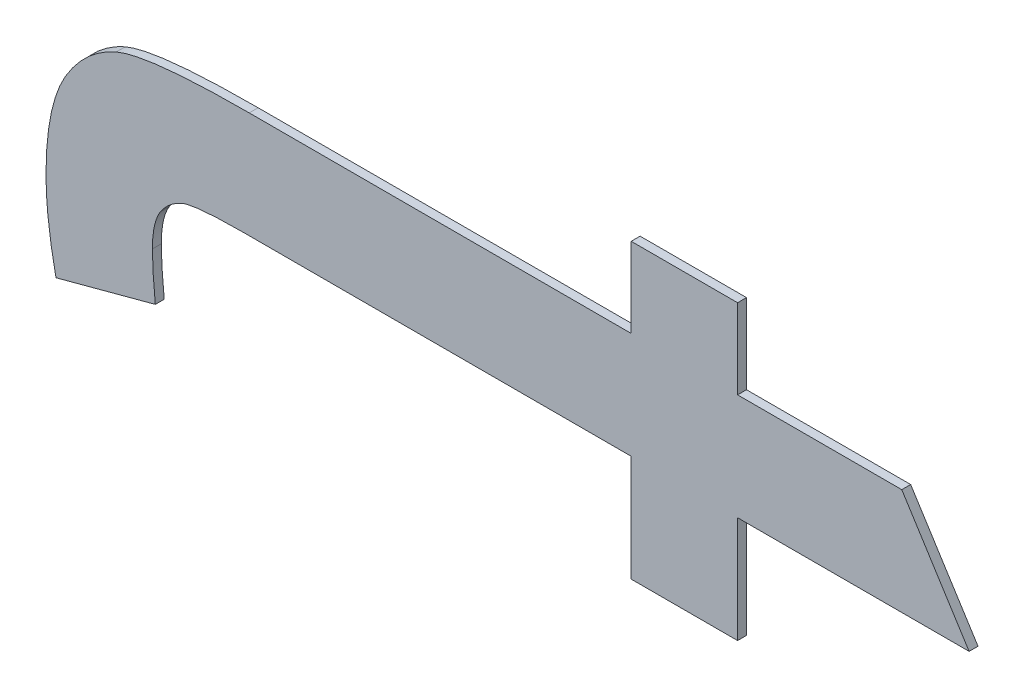
ISO-10303-21;
HEADER;
FILE_DESCRIPTION(('STEP AP214'),'2;1');
FILE_NAME('part.step','',(''),(''),'','','');
FILE_SCHEMA(('AUTOMOTIVE_DESIGN { 1 0 10303 214 1 1 1 1 }'));
ENDSEC;
DATA;
#1=APPLICATION_CONTEXT('core data for automotive mechanical design processes');
#2=APPLICATION_PROTOCOL_DEFINITION('international standard','automotive_design',2000,#1);
#3=PRODUCT_CONTEXT('',#1,'mechanical');
#4=PRODUCT('Part','Part','',(#3));
#5=PRODUCT_RELATED_PRODUCT_CATEGORY('part','',(#4));
#6=PRODUCT_DEFINITION_FORMATION('','',#4);
#7=PRODUCT_DEFINITION_CONTEXT('part definition',#1,'design');
#8=PRODUCT_DEFINITION('design','',#6,#7);
#9=PRODUCT_DEFINITION_SHAPE('','',#8);
#10=(LENGTH_UNIT() NAMED_UNIT(*) SI_UNIT(.MILLI.,.METRE.));
#11=(NAMED_UNIT(*) PLANE_ANGLE_UNIT() SI_UNIT($,.RADIAN.));
#12=(NAMED_UNIT(*) SI_UNIT($,.STERADIAN.) SOLID_ANGLE_UNIT());
#13=UNCERTAINTY_MEASURE_WITH_UNIT(LENGTH_MEASURE(1.E-05),#10,'distance_accuracy_value','');
#14=(GEOMETRIC_REPRESENTATION_CONTEXT(3) GLOBAL_UNCERTAINTY_ASSIGNED_CONTEXT((#13)) GLOBAL_UNIT_ASSIGNED_CONTEXT((#10,
#11,#12)) REPRESENTATION_CONTEXT('',''));
#15=CARTESIAN_POINT('',(0.,0.,0.));
#16=DIRECTION('',(0.,0.,1.));
#17=DIRECTION('',(1.,0.,0.));
#18=AXIS2_PLACEMENT_3D('',#15,#16,#17);
#19=CARTESIAN_POINT('',(1.0877452835503,1.4763023259655,1.7496000059366));
#20=DIRECTION('',(0.258668743012333,-0.965966087079883,0.));
#21=DIRECTION('',(0.,0.,-1.));
#22=AXIS2_PLACEMENT_3D('',#19,#20,#21);
#23=PLANE('',#22);
#24=DIRECTION('',(0.,0.,1.));
#25=VECTOR('',#24,1.);
#26=CARTESIAN_POINT('',(1.0899779799409,1.4769002028233,1.7492000059366));
#27=LINE('',#26,#25);
#28=CARTESIAN_POINT('',(1.0899779799409,1.4769002028233,1.7492000059366));
#29=VERTEX_POINT('',#28);
#30=CARTESIAN_POINT('',(1.0899779799409,1.4769002028233,1.7496000059366));
#31=VERTEX_POINT('',#30);
#32=EDGE_CURVE('E11',#29,#31,#27,.T.);
#33=ORIENTED_EDGE('',*,*,#32,.T.);
#34=DIRECTION('',(-0.965966087079883,-0.258668743012333,0.));
#35=VECTOR('',#34,1.);
#36=CARTESIAN_POINT('',(1.0899779799409,1.4769002028233,1.7496000059366));
#37=LINE('',#36,#35);
#38=CARTESIAN_POINT('',(1.0855125871597,1.4757044491077,1.7496000059366));
#39=VERTEX_POINT('',#38);
#40=EDGE_CURVE('E24',#31,#39,#37,.T.);
#41=ORIENTED_EDGE('',*,*,#40,.T.);
#42=DIRECTION('',(0.,0.,1.));
#43=VECTOR('',#42,1.);
#44=CARTESIAN_POINT('',(1.0855125871597,1.4757044491077,1.7492000059366));
#45=LINE('',#44,#43);
#46=CARTESIAN_POINT('',(1.0855125871597,1.4757044491077,1.7492000059366));
#47=VERTEX_POINT('',#46);
#48=EDGE_CURVE('E389',#47,#39,#45,.T.);
#49=ORIENTED_EDGE('',*,*,#48,.F.);
#50=DIRECTION('',(-0.965966087079883,-0.258668743012333,0.));
#51=VECTOR('',#50,1.);
#52=CARTESIAN_POINT('',(1.0899779799409,1.4769002028233,1.7492000059366));
#53=LINE('',#52,#51);
#54=EDGE_CURVE('E384',#29,#47,#53,.T.);
#55=ORIENTED_EDGE('',*,*,#54,.F.);
#56=EDGE_LOOP('',(#33,#41,#49,#55));
#57=FACE_BOUND('',#56,.T.);
#58=ADVANCED_FACE('F17',(#57),#23,.T.);
#59=CARTESIAN_POINT('',(1.0855125871597,1.4757044491077,1.7496000059366));
#60=CARTESIAN_POINT('',(1.0855125871597,1.4757044491077,1.7491200059366));
#61=CARTESIAN_POINT('',(1.0850641795163,1.4778157017617,1.7496000059366));
#62=CARTESIAN_POINT('',(1.0850641795163,1.4778157017617,1.7491200059366));
#63=CARTESIAN_POINT('',(1.0850641795163,1.4794972304241,1.7496000059366));
#64=CARTESIAN_POINT('',(1.0850641795163,1.4794972304241,1.7491200059366));
#65=B_SPLINE_SURFACE_WITH_KNOTS('',2,1,((#59,#60),(#61,#62),(#63,#64)),.UNSPECIFIED.,.F.,.F.,
.F.,(3,3),(2,2),(0.,1.),(0.,0.000239999999999974),.UNSPECIFIED.);
#66=CARTESIAN_POINT('',(1.0855125871597,1.4757044491077,1.7496000059366));
#67=CARTESIAN_POINT('',(1.0850641795163,1.4778157017617,1.7496000059366));
#68=CARTESIAN_POINT('',(1.0850641795163,1.4794972304241,1.7496000059366));
#69=B_SPLINE_CURVE_WITH_KNOTS('',2,(#66,#67,#68),.UNSPECIFIED.,.F.,.F.,(3,3),(0.,1.),.UNSPECIFIED.);
#70=CARTESIAN_POINT('',(1.0850641795163,1.4794972304241,1.7496000059366));
#71=VERTEX_POINT('',#70);
#72=EDGE_CURVE('E380',#39,#71,#69,.T.);
#73=DIRECTION('',(0.,0.,1.));
#74=VECTOR('',#73,1.);
#75=CARTESIAN_POINT('',(1.0850641795163,1.4794972304241,1.7492000059366));
#76=LINE('',#75,#74);
#77=CARTESIAN_POINT('',(1.0850641795163,1.4794972304241,1.7492000059366));
#78=VERTEX_POINT('',#77);
#79=EDGE_CURVE('E374',#78,#71,#76,.T.);
#80=CARTESIAN_POINT('',(1.0855125871597,1.4757044491077,1.7492000059366));
#81=CARTESIAN_POINT('',(1.0850641795163,1.4778157017617,1.7492000059366));
#82=CARTESIAN_POINT('',(1.0850641795163,1.4794972304241,1.7492000059366));
#83=B_SPLINE_CURVE_WITH_KNOTS('',2,(#80,#81,#82),.UNSPECIFIED.,.F.,.F.,(3,3),(0.,1.),.UNSPECIFIED.);
#84=EDGE_CURVE('E366',#47,#78,#83,.T.);
#85=ORIENTED_EDGE('',*,*,#48,.T.);
#86=ORIENTED_EDGE('',*,*,#72,.T.);
#87=ORIENTED_EDGE('',*,*,#79,.F.);
#88=ORIENTED_EDGE('',*,*,#84,.F.);
#89=EDGE_LOOP('',(#85,#86,#87,#88));
#90=FACE_BOUND('',#89,.T.);
#91=ADVANCED_FACE('F395',(#90),#65,.T.);
#92=CARTESIAN_POINT('',(1.0850641795163,1.4794972304241,1.7496000059366));
#93=CARTESIAN_POINT('',(1.0850641795163,1.4794972304241,1.7491200059366));
#94=CARTESIAN_POINT('',(1.0850641795163,1.4822250435875,1.7496000059366));
#95=CARTESIAN_POINT('',(1.0850641795163,1.4822250435875,1.7491200059366));
#96=CARTESIAN_POINT('',(1.0859236274993,1.4837384193837,1.7496000059366));
#97=CARTESIAN_POINT('',(1.0859236274993,1.4837384193837,1.7491200059366));
#98=B_SPLINE_SURFACE_WITH_KNOTS('',2,1,((#92,#93),(#94,#95),(#96,#97)),.UNSPECIFIED.,.F.,.F.,
.F.,(3,3),(2,2),(0.,1.),(0.,0.000239999999999974),.UNSPECIFIED.);
#99=CARTESIAN_POINT('',(1.0850641795163,1.4794972304241,1.7496000059366));
#100=CARTESIAN_POINT('',(1.0850641795163,1.4822250435875,1.7496000059366));
#101=CARTESIAN_POINT('',(1.0859236274993,1.4837384193837,1.7496000059366));
#102=B_SPLINE_CURVE_WITH_KNOTS('',2,(#99,#100,#101),.UNSPECIFIED.,.F.,.F.,(3,3),(0.,1.),.UNSPECIFIED.);
#103=CARTESIAN_POINT('',(1.0859236274993,1.4837384193837,1.7496000059366));
#104=VERTEX_POINT('',#103);
#105=EDGE_CURVE('E362',#71,#104,#102,.T.);
#106=DIRECTION('',(0.,0.,1.));
#107=VECTOR('',#106,1.);
#108=CARTESIAN_POINT('',(1.0859236274993,1.4837384193837,1.7492000059366));
#109=LINE('',#108,#107);
#110=CARTESIAN_POINT('',(1.0859236274993,1.4837384193837,1.7492000059366));
#111=VERTEX_POINT('',#110);
#112=EDGE_CURVE('E356',#111,#104,#109,.T.);
#113=CARTESIAN_POINT('',(1.0850641795163,1.4794972304241,1.7492000059366));
#114=CARTESIAN_POINT('',(1.0850641795163,1.4822250435875,1.7492000059366));
#115=CARTESIAN_POINT('',(1.0859236274993,1.4837384193837,1.7492000059366));
#116=B_SPLINE_CURVE_WITH_KNOTS('',2,(#113,#114,#115),.UNSPECIFIED.,.F.,.F.,(3,3),(0.,1.),.UNSPECIFIED.);
#117=EDGE_CURVE('E348',#78,#111,#116,.T.);
#118=ORIENTED_EDGE('',*,*,#79,.T.);
#119=ORIENTED_EDGE('',*,*,#105,.T.);
#120=ORIENTED_EDGE('',*,*,#112,.F.);
#121=ORIENTED_EDGE('',*,*,#117,.F.);
#122=EDGE_LOOP('',(#118,#119,#120,#121));
#123=FACE_BOUND('',#122,.T.);
#124=ADVANCED_FACE('F401',(#123),#98,.T.);
#125=CARTESIAN_POINT('',(1.0859236274993,1.4837384193837,1.7496000059366));
#126=CARTESIAN_POINT('',(1.0859236274993,1.4837384193837,1.7491200059366));
#127=CARTESIAN_POINT('',(1.0868017591341,1.4852331115281,1.7496000059366));
#128=CARTESIAN_POINT('',(1.0868017591341,1.4852331115281,1.7491200059366));
#129=CARTESIAN_POINT('',(1.0882217166713,1.4858496720377,1.7496000059366));
#130=CARTESIAN_POINT('',(1.0882217166713,1.4858496720377,1.7491200059366));
#131=B_SPLINE_SURFACE_WITH_KNOTS('',2,1,((#125,#126),(#127,#128),(#129,#130)),.UNSPECIFIED.,.F.,
.F.,.F.,(3,3),(2,2),(0.,1.),(0.,0.000239999999999974),.UNSPECIFIED.);
#132=CARTESIAN_POINT('',(1.0859236274993,1.4837384193837,1.7496000059366));
#133=CARTESIAN_POINT('',(1.0868017591341,1.4852331115281,1.7496000059366));
#134=CARTESIAN_POINT('',(1.0882217166713,1.4858496720377,1.7496000059366));
#135=B_SPLINE_CURVE_WITH_KNOTS('',2,(#132,#133,#134),.UNSPECIFIED.,.F.,.F.,(3,3),(0.,1.),.UNSPECIFIED.);
#136=CARTESIAN_POINT('',(1.0882217166713,1.4858496720377,1.7496000059366));
#137=VERTEX_POINT('',#136);
#138=EDGE_CURVE('E344',#104,#137,#135,.T.);
#139=DIRECTION('',(0.,0.,1.));
#140=VECTOR('',#139,1.);
#141=CARTESIAN_POINT('',(1.0882217166713,1.4858496720377,1.7492000059366));
#142=LINE('',#141,#140);
#143=CARTESIAN_POINT('',(1.0882217166713,1.4858496720377,1.7492000059366));
#144=VERTEX_POINT('',#143);
#145=EDGE_CURVE('E338',#144,#137,#142,.T.);
#146=CARTESIAN_POINT('',(1.0859236274993,1.4837384193837,1.7492000059366));
#147=CARTESIAN_POINT('',(1.0868017591341,1.4852331115281,1.7492000059366));
#148=CARTESIAN_POINT('',(1.0882217166713,1.4858496720377,1.7492000059366));
#149=B_SPLINE_CURVE_WITH_KNOTS('',2,(#146,#147,#148),.UNSPECIFIED.,.F.,.F.,(3,3),(0.,1.),.UNSPECIFIED.);
#150=EDGE_CURVE('E330',#111,#144,#149,.T.);
#151=ORIENTED_EDGE('',*,*,#112,.T.);
#152=ORIENTED_EDGE('',*,*,#138,.T.);
#153=ORIENTED_EDGE('',*,*,#145,.F.);
#154=ORIENTED_EDGE('',*,*,#150,.F.);
#155=EDGE_LOOP('',(#151,#152,#153,#154));
#156=FACE_BOUND('',#155,.T.);
#157=ADVANCED_FACE('F405',(#156),#131,.T.);
#158=CARTESIAN_POINT('',(1.0882217166713,1.4858496720377,1.7496000059366));
#159=CARTESIAN_POINT('',(1.0882217166713,1.4858496720377,1.7491200059366));
#160=CARTESIAN_POINT('',(1.0896416742085,1.4864662325471,1.7496000059366));
#161=CARTESIAN_POINT('',(1.0896416742085,1.4864662325471,1.7491200059366));
#162=CARTESIAN_POINT('',(1.0942004852487,1.4864662325471,1.7496000059366));
#163=CARTESIAN_POINT('',(1.0942004852487,1.4864662325471,1.7491200059366));
#164=B_SPLINE_SURFACE_WITH_KNOTS('',2,1,((#158,#159),(#160,#161),(#162,#163)),.UNSPECIFIED.,.F.,
.F.,.F.,(3,3),(2,2),(0.,1.),(0.,0.000239999999999974),.UNSPECIFIED.);
#165=CARTESIAN_POINT('',(1.0882217166713,1.4858496720377,1.7496000059366));
#166=CARTESIAN_POINT('',(1.0896416742085,1.4864662325471,1.7496000059366));
#167=CARTESIAN_POINT('',(1.0942004852487,1.4864662325471,1.7496000059366));
#168=B_SPLINE_CURVE_WITH_KNOTS('',2,(#165,#166,#167),.UNSPECIFIED.,.F.,.F.,(3,3),(0.,1.),.UNSPECIFIED.);
#169=CARTESIAN_POINT('',(1.0942004852487,1.4864662325471,1.7496000059366));
#170=VERTEX_POINT('',#169);
#171=EDGE_CURVE('E326',#137,#170,#168,.T.);
#172=DIRECTION('',(0.,0.,1.));
#173=VECTOR('',#172,1.);
#174=CARTESIAN_POINT('',(1.0942004852487,1.4864662325471,1.7492000059366));
#175=LINE('',#174,#173);
#176=CARTESIAN_POINT('',(1.0942004852487,1.4864662325471,1.7492000059366));
#177=VERTEX_POINT('',#176);
#178=EDGE_CURVE('E320',#177,#170,#175,.T.);
#179=CARTESIAN_POINT('',(1.0882217166713,1.4858496720377,1.7492000059366));
#180=CARTESIAN_POINT('',(1.0896416742085,1.4864662325471,1.7492000059366));
#181=CARTESIAN_POINT('',(1.0942004852487,1.4864662325471,1.7492000059366));
#182=B_SPLINE_CURVE_WITH_KNOTS('',2,(#179,#180,#181),.UNSPECIFIED.,.F.,.F.,(3,3),(0.,1.),.UNSPECIFIED.);
#183=EDGE_CURVE('E315',#144,#177,#182,.T.);
#184=ORIENTED_EDGE('',*,*,#145,.T.);
#185=ORIENTED_EDGE('',*,*,#171,.T.);
#186=ORIENTED_EDGE('',*,*,#178,.F.);
#187=ORIENTED_EDGE('',*,*,#183,.F.);
#188=EDGE_LOOP('',(#184,#185,#186,#187));
#189=FACE_BOUND('',#188,.T.);
#190=ADVANCED_FACE('F409',(#189),#164,.T.);
#191=CARTESIAN_POINT('',(1.102785623253,1.4864662325471,1.7496000059366));
#192=DIRECTION('',(0.,1.,0.));
#193=DIRECTION('',(0.,0.,1.));
#194=AXIS2_PLACEMENT_3D('',#191,#192,#193);
#195=PLANE('',#194);
#196=ORIENTED_EDGE('',*,*,#178,.T.);
#197=DIRECTION('',(1.,0.,0.));
#198=VECTOR('',#197,1.);
#199=CARTESIAN_POINT('',(1.0942004852487,1.4864662325471,1.7496000059366));
#200=LINE('',#199,#198);
#201=CARTESIAN_POINT('',(1.1113707612573,1.4864662325471,1.7496000059366));
#202=VERTEX_POINT('',#201);
#203=EDGE_CURVE('E313',#170,#202,#200,.T.);
#204=ORIENTED_EDGE('',*,*,#203,.T.);
#205=DIRECTION('',(0.,0.,1.));
#206=VECTOR('',#205,1.);
#207=CARTESIAN_POINT('',(1.1113707612573,1.4864662325471,1.7492000059366));
#208=LINE('',#207,#206);
#209=CARTESIAN_POINT('',(1.1113707612573,1.4864662325471,1.7492000059366));
#210=VERTEX_POINT('',#209);
#211=EDGE_CURVE('E310',#210,#202,#208,.T.);
#212=ORIENTED_EDGE('',*,*,#211,.F.);
#213=DIRECTION('',(1.,0.,0.));
#214=VECTOR('',#213,1.);
#215=CARTESIAN_POINT('',(1.0942004852487,1.4864662325471,1.7492000059366));
#216=LINE('',#215,#214);
#217=EDGE_CURVE('E307',#177,#210,#216,.T.);
#218=ORIENTED_EDGE('',*,*,#217,.F.);
#219=EDGE_LOOP('',(#196,#204,#212,#218));
#220=FACE_BOUND('',#219,.T.);
#221=ADVANCED_FACE('F412',(#220),#195,.T.);
#222=CARTESIAN_POINT('',(1.1113707612573,1.4882598631204,1.7496000059366));
#223=DIRECTION('',(-1.,0.,0.));
#224=DIRECTION('',(0.,0.,1.));
#225=AXIS2_PLACEMENT_3D('',#222,#223,#224);
#226=PLANE('',#225);
#227=ORIENTED_EDGE('',*,*,#211,.T.);
#228=DIRECTION('',(0.,1.,0.));
#229=VECTOR('',#228,1.);
#230=CARTESIAN_POINT('',(1.1113707612573,1.4864662325471,1.7496000059366));
#231=LINE('',#230,#229);
#232=CARTESIAN_POINT('',(1.1113707612573,1.4900534936937,1.7496000059366));
#233=VERTEX_POINT('',#232);
#234=EDGE_CURVE('E305',#202,#233,#231,.T.);
#235=ORIENTED_EDGE('',*,*,#234,.T.);
#236=DIRECTION('',(0.,0.,1.));
#237=VECTOR('',#236,1.);
#238=CARTESIAN_POINT('',(1.1113707612573,1.4900534936937,1.7492000059366));
#239=LINE('',#238,#237);
#240=CARTESIAN_POINT('',(1.1113707612573,1.4900534936937,1.7492000059366));
#241=VERTEX_POINT('',#240);
#242=EDGE_CURVE('E302',#241,#233,#239,.T.);
#243=ORIENTED_EDGE('',*,*,#242,.F.);
#244=DIRECTION('',(0.,1.,0.));
#245=VECTOR('',#244,1.);
#246=CARTESIAN_POINT('',(1.1113707612573,1.4864662325471,1.7492000059366));
#247=LINE('',#246,#245);
#248=EDGE_CURVE('E299',#210,#241,#247,.T.);
#249=ORIENTED_EDGE('',*,*,#248,.F.);
#250=EDGE_LOOP('',(#227,#235,#243,#249));
#251=FACE_BOUND('',#250,.T.);
#252=ADVANCED_FACE('F417',(#251),#226,.T.);
#253=CARTESIAN_POINT('',(1.1137622686883,1.4900534936937,1.7496000059366));
#254=DIRECTION('',(0.,1.,0.));
#255=DIRECTION('',(0.,0.,1.));
#256=AXIS2_PLACEMENT_3D('',#253,#254,#255);
#257=PLANE('',#256);
#258=ORIENTED_EDGE('',*,*,#242,.T.);
#259=DIRECTION('',(1.,0.,0.));
#260=VECTOR('',#259,1.);
#261=CARTESIAN_POINT('',(1.1113707612573,1.4900534936937,1.7496000059366));
#262=LINE('',#261,#260);
#263=CARTESIAN_POINT('',(1.1161537761193,1.4900534936937,1.7496000059366));
#264=VERTEX_POINT('',#263);
#265=EDGE_CURVE('E297',#233,#264,#262,.T.);
#266=ORIENTED_EDGE('',*,*,#265,.T.);
#267=DIRECTION('',(0.,0.,1.));
#268=VECTOR('',#267,1.);
#269=CARTESIAN_POINT('',(1.1161537761193,1.4900534936937,1.7492000059366));
#270=LINE('',#269,#268);
#271=CARTESIAN_POINT('',(1.1161537761193,1.4900534936937,1.7492000059366));
#272=VERTEX_POINT('',#271);
#273=EDGE_CURVE('E294',#272,#264,#270,.T.);
#274=ORIENTED_EDGE('',*,*,#273,.F.);
#275=DIRECTION('',(1.,0.,0.));
#276=VECTOR('',#275,1.);
#277=CARTESIAN_POINT('',(1.1113707612573,1.4900534936937,1.7492000059366));
#278=LINE('',#277,#276);
#279=EDGE_CURVE('E291',#241,#272,#278,.T.);
#280=ORIENTED_EDGE('',*,*,#279,.F.);
#281=EDGE_LOOP('',(#258,#266,#274,#280));
#282=FACE_BOUND('',#281,.T.);
#283=ADVANCED_FACE('F421',(#282),#257,.T.);
#284=CARTESIAN_POINT('',(1.1161537761193,1.4882598631204,1.7496000059366));
#285=DIRECTION('',(1.,0.,0.));
#286=DIRECTION('',(0.,0.,-1.));
#287=AXIS2_PLACEMENT_3D('',#284,#285,#286);
#288=PLANE('',#287);
#289=ORIENTED_EDGE('',*,*,#273,.T.);
#290=DIRECTION('',(0.,-1.,0.));
#291=VECTOR('',#290,1.);
#292=CARTESIAN_POINT('',(1.1161537761193,1.4900534936937,1.7496000059366));
#293=LINE('',#292,#291);
#294=CARTESIAN_POINT('',(1.1161537761193,1.4864662325471,1.7496000059366));
#295=VERTEX_POINT('',#294);
#296=EDGE_CURVE('E289',#264,#295,#293,.T.);
#297=ORIENTED_EDGE('',*,*,#296,.T.);
#298=DIRECTION('',(0.,0.,1.));
#299=VECTOR('',#298,1.);
#300=CARTESIAN_POINT('',(1.1161537761193,1.4864662325471,1.7492000059366));
#301=LINE('',#300,#299);
#302=CARTESIAN_POINT('',(1.1161537761193,1.4864662325471,1.7492000059366));
#303=VERTEX_POINT('',#302);
#304=EDGE_CURVE('E286',#303,#295,#301,.T.);
#305=ORIENTED_EDGE('',*,*,#304,.F.);
#306=DIRECTION('',(0.,-1.,0.));
#307=VECTOR('',#306,1.);
#308=CARTESIAN_POINT('',(1.1161537761193,1.4900534936937,1.7492000059366));
#309=LINE('',#308,#307);
#310=EDGE_CURVE('E283',#272,#303,#309,.T.);
#311=ORIENTED_EDGE('',*,*,#310,.F.);
#312=EDGE_LOOP('',(#289,#297,#305,#311));
#313=FACE_BOUND('',#312,.T.);
#314=ADVANCED_FACE('F425',(#313),#288,.T.);
#315=CARTESIAN_POINT('',(1.1198437973507,1.4864662325471,1.7496000059366));
#316=DIRECTION('',(0.,1.,0.));
#317=DIRECTION('',(0.,0.,1.));
#318=AXIS2_PLACEMENT_3D('',#315,#316,#317);
#319=PLANE('',#318);
#320=ORIENTED_EDGE('',*,*,#304,.T.);
#321=DIRECTION('',(1.,0.,0.));
#322=VECTOR('',#321,1.);
#323=CARTESIAN_POINT('',(1.1161537761193,1.4864662325471,1.7496000059366));
#324=LINE('',#323,#322);
#325=CARTESIAN_POINT('',(1.1235338185821,1.4864662325471,1.7496000059366));
#326=VERTEX_POINT('',#325);
#327=EDGE_CURVE('E281',#295,#326,#324,.T.);
#328=ORIENTED_EDGE('',*,*,#327,.T.);
#329=DIRECTION('',(0.,0.,1.));
#330=VECTOR('',#329,1.);
#331=CARTESIAN_POINT('',(1.1235338185821,1.4864662325471,1.7492000059366));
#332=LINE('',#331,#330);
#333=CARTESIAN_POINT('',(1.1235338185821,1.4864662325471,1.7492000059366));
#334=VERTEX_POINT('',#333);
#335=EDGE_CURVE('E278',#334,#326,#332,.T.);
#336=ORIENTED_EDGE('',*,*,#335,.F.);
#337=DIRECTION('',(1.,0.,0.));
#338=VECTOR('',#337,1.);
#339=CARTESIAN_POINT('',(1.1161537761193,1.4864662325471,1.7492000059366));
#340=LINE('',#339,#338);
#341=EDGE_CURVE('E275',#303,#334,#340,.T.);
#342=ORIENTED_EDGE('',*,*,#341,.F.);
#343=EDGE_LOOP('',(#320,#328,#336,#342));
#344=FACE_BOUND('',#343,.T.);
#345=ADVANCED_FACE('F428',(#344),#319,.T.);
#346=CARTESIAN_POINT('',(1.1250471943783,1.4840747251162,1.7496000059366));
#347=DIRECTION('',(0.845017958227429,0.534737926720321,0.));
#348=DIRECTION('',(0.,0.,-1.));
#349=AXIS2_PLACEMENT_3D('',#346,#347,#348);
#350=PLANE('',#349);
#351=ORIENTED_EDGE('',*,*,#335,.T.);
#352=DIRECTION('',(0.534737926720321,-0.845017958227429,0.));
#353=VECTOR('',#352,1.);
#354=CARTESIAN_POINT('',(1.1235338185821,1.4864662325471,1.7496000059366));
#355=LINE('',#354,#353);
#356=CARTESIAN_POINT('',(1.1265605701745,1.4816832176853,1.7496000059366));
#357=VERTEX_POINT('',#356);
#358=EDGE_CURVE('E273',#326,#357,#355,.T.);
#359=ORIENTED_EDGE('',*,*,#358,.T.);
#360=DIRECTION('',(0.,0.,1.));
#361=VECTOR('',#360,1.);
#362=CARTESIAN_POINT('',(1.1265605701745,1.4816832176853,1.7492000059366));
#363=LINE('',#362,#361);
#364=CARTESIAN_POINT('',(1.1265605701745,1.4816832176853,1.7492000059366));
#365=VERTEX_POINT('',#364);
#366=EDGE_CURVE('E270',#365,#357,#363,.T.);
#367=ORIENTED_EDGE('',*,*,#366,.F.);
#368=DIRECTION('',(0.534737926720321,-0.845017958227429,0.));
#369=VECTOR('',#368,1.);
#370=CARTESIAN_POINT('',(1.1235338185821,1.4864662325471,1.7492000059366));
#371=LINE('',#370,#369);
#372=EDGE_CURVE('E267',#334,#365,#371,.T.);
#373=ORIENTED_EDGE('',*,*,#372,.F.);
#374=EDGE_LOOP('',(#351,#359,#367,#373));
#375=FACE_BOUND('',#374,.T.);
#376=ADVANCED_FACE('F433',(#375),#350,.T.);
#377=CARTESIAN_POINT('',(1.1213571731469,1.4816832176853,1.7496000059366));
#378=DIRECTION('',(0.,-1.,0.));
#379=DIRECTION('',(0.,0.,-1.));
#380=AXIS2_PLACEMENT_3D('',#377,#378,#379);
#381=PLANE('',#380);
#382=ORIENTED_EDGE('',*,*,#366,.T.);
#383=DIRECTION('',(-1.,0.,0.));
#384=VECTOR('',#383,1.);
#385=CARTESIAN_POINT('',(1.1265605701745,1.4816832176853,1.7496000059366));
#386=LINE('',#385,#384);
#387=CARTESIAN_POINT('',(1.1161537761193,1.4816832176853,1.7496000059366));
#388=VERTEX_POINT('',#387);
#389=EDGE_CURVE('E265',#357,#388,#386,.T.);
#390=ORIENTED_EDGE('',*,*,#389,.T.);
#391=DIRECTION('',(0.,0.,1.));
#392=VECTOR('',#391,1.);
#393=CARTESIAN_POINT('',(1.1161537761193,1.4816832176853,1.7492000059366));
#394=LINE('',#393,#392);
#395=CARTESIAN_POINT('',(1.1161537761193,1.4816832176853,1.7492000059366));
#396=VERTEX_POINT('',#395);
#397=EDGE_CURVE('E262',#396,#388,#394,.T.);
#398=ORIENTED_EDGE('',*,*,#397,.F.);
#399=DIRECTION('',(-1.,0.,0.));
#400=VECTOR('',#399,1.);
#401=CARTESIAN_POINT('',(1.1265605701745,1.4816832176853,1.7492000059366));
#402=LINE('',#401,#400);
#403=EDGE_CURVE('E259',#365,#396,#402,.T.);
#404=ORIENTED_EDGE('',*,*,#403,.F.);
#405=EDGE_LOOP('',(#382,#390,#398,#404));
#406=FACE_BOUND('',#405,.T.);
#407=ADVANCED_FACE('F437',(#406),#381,.T.);
#408=CARTESIAN_POINT('',(1.1161537761193,1.4792917102543,1.7496000059366));
#409=DIRECTION('',(1.,0.,0.));
#410=DIRECTION('',(0.,0.,-1.));
#411=AXIS2_PLACEMENT_3D('',#408,#409,#410);
#412=PLANE('',#411);
#413=ORIENTED_EDGE('',*,*,#397,.T.);
#414=DIRECTION('',(0.,-1.,0.));
#415=VECTOR('',#414,1.);
#416=CARTESIAN_POINT('',(1.1161537761193,1.4816832176853,1.7496000059366));
#417=LINE('',#416,#415);
#418=CARTESIAN_POINT('',(1.1161537761193,1.4769002028233,1.7496000059366));
#419=VERTEX_POINT('',#418);
#420=EDGE_CURVE('E257',#388,#419,#417,.T.);
#421=ORIENTED_EDGE('',*,*,#420,.T.);
#422=DIRECTION('',(0.,0.,1.));
#423=VECTOR('',#422,1.);
#424=CARTESIAN_POINT('',(1.1161537761193,1.4769002028233,1.7492000059366));
#425=LINE('',#424,#423);
#426=CARTESIAN_POINT('',(1.1161537761193,1.4769002028233,1.7492000059366));
#427=VERTEX_POINT('',#426);
#428=EDGE_CURVE('E254',#427,#419,#425,.T.);
#429=ORIENTED_EDGE('',*,*,#428,.F.);
#430=DIRECTION('',(0.,-1.,0.));
#431=VECTOR('',#430,1.);
#432=CARTESIAN_POINT('',(1.1161537761193,1.4816832176853,1.7492000059366));
#433=LINE('',#432,#431);
#434=EDGE_CURVE('E251',#396,#427,#433,.T.);
#435=ORIENTED_EDGE('',*,*,#434,.F.);
#436=EDGE_LOOP('',(#413,#421,#429,#435));
#437=FACE_BOUND('',#436,.T.);
#438=ADVANCED_FACE('F441',(#437),#412,.T.);
#439=CARTESIAN_POINT('',(1.1137622686883,1.4769002028233,1.7496000059366));
#440=DIRECTION('',(0.,-1.,0.));
#441=DIRECTION('',(0.,0.,-1.));
#442=AXIS2_PLACEMENT_3D('',#439,#440,#441);
#443=PLANE('',#442);
#444=ORIENTED_EDGE('',*,*,#428,.T.);
#445=DIRECTION('',(-1.,0.,0.));
#446=VECTOR('',#445,1.);
#447=CARTESIAN_POINT('',(1.1161537761193,1.4769002028233,1.7496000059366));
#448=LINE('',#447,#446);
#449=CARTESIAN_POINT('',(1.1113707612573,1.4769002028233,1.7496000059366));
#450=VERTEX_POINT('',#449);
#451=EDGE_CURVE('E249',#419,#450,#448,.T.);
#452=ORIENTED_EDGE('',*,*,#451,.T.);
#453=DIRECTION('',(0.,0.,1.));
#454=VECTOR('',#453,1.);
#455=CARTESIAN_POINT('',(1.1113707612573,1.4769002028233,1.7492000059366));
#456=LINE('',#455,#454);
#457=CARTESIAN_POINT('',(1.1113707612573,1.4769002028233,1.7492000059366));
#458=VERTEX_POINT('',#457);
#459=EDGE_CURVE('E246',#458,#450,#456,.T.);
#460=ORIENTED_EDGE('',*,*,#459,.F.);
#461=DIRECTION('',(-1.,0.,0.));
#462=VECTOR('',#461,1.);
#463=CARTESIAN_POINT('',(1.1161537761193,1.4769002028233,1.7492000059366));
#464=LINE('',#463,#462);
#465=EDGE_CURVE('E243',#427,#458,#464,.T.);
#466=ORIENTED_EDGE('',*,*,#465,.F.);
#467=EDGE_LOOP('',(#444,#452,#460,#466));
#468=FACE_BOUND('',#467,.T.);
#469=ADVANCED_FACE('F444',(#468),#443,.T.);
#470=CARTESIAN_POINT('',(1.1113707612573,1.4792917102543,1.7496000059366));
#471=DIRECTION('',(-1.,0.,0.));
#472=DIRECTION('',(0.,0.,1.));
#473=AXIS2_PLACEMENT_3D('',#470,#471,#472);
#474=PLANE('',#473);
#475=ORIENTED_EDGE('',*,*,#459,.T.);
#476=DIRECTION('',(0.,1.,0.));
#477=VECTOR('',#476,1.);
#478=CARTESIAN_POINT('',(1.1113707612573,1.4769002028233,1.7496000059366));
#479=LINE('',#478,#477);
#480=CARTESIAN_POINT('',(1.1113707612573,1.4816832176853,1.7496000059366));
#481=VERTEX_POINT('',#480);
#482=EDGE_CURVE('E241',#450,#481,#479,.T.);
#483=ORIENTED_EDGE('',*,*,#482,.T.);
#484=DIRECTION('',(0.,0.,1.));
#485=VECTOR('',#484,1.);
#486=CARTESIAN_POINT('',(1.1113707612573,1.4816832176853,1.7492000059366));
#487=LINE('',#486,#485);
#488=CARTESIAN_POINT('',(1.1113707612573,1.4816832176853,1.7492000059366));
#489=VERTEX_POINT('',#488);
#490=EDGE_CURVE('E238',#489,#481,#487,.T.);
#491=ORIENTED_EDGE('',*,*,#490,.F.);
#492=DIRECTION('',(0.,1.,0.));
#493=VECTOR('',#492,1.);
#494=CARTESIAN_POINT('',(1.1113707612573,1.4769002028233,1.7492000059366));
#495=LINE('',#494,#493);
#496=EDGE_CURVE('E235',#458,#489,#495,.T.);
#497=ORIENTED_EDGE('',*,*,#496,.F.);
#498=EDGE_LOOP('',(#475,#483,#491,#497));
#499=FACE_BOUND('',#498,.T.);
#500=ADVANCED_FACE('F449',(#499),#474,.T.);
#501=CARTESIAN_POINT('',(1.1026735213422,1.4816832176853,1.7496000059366));
#502=DIRECTION('',(0.,-1.,0.));
#503=DIRECTION('',(0.,0.,-1.));
#504=AXIS2_PLACEMENT_3D('',#501,#502,#503);
#505=PLANE('',#504);
#506=ORIENTED_EDGE('',*,*,#490,.T.);
#507=DIRECTION('',(-1.,0.,0.));
#508=VECTOR('',#507,1.);
#509=CARTESIAN_POINT('',(1.1113707612573,1.4816832176853,1.7496000059366));
#510=LINE('',#509,#508);
#511=CARTESIAN_POINT('',(1.0939762814271,1.4816832176853,1.7496000059366));
#512=VERTEX_POINT('',#511);
#513=EDGE_CURVE('E233',#481,#512,#510,.T.);
#514=ORIENTED_EDGE('',*,*,#513,.T.);
#515=DIRECTION('',(0.,0.,1.));
#516=VECTOR('',#515,1.);
#517=CARTESIAN_POINT('',(1.0939762814271,1.4816832176853,1.7492000059366));
#518=LINE('',#517,#516);
#519=CARTESIAN_POINT('',(1.0939762814271,1.4816832176853,1.7492000059366));
#520=VERTEX_POINT('',#519);
#521=EDGE_CURVE('E230',#520,#512,#518,.T.);
#522=ORIENTED_EDGE('',*,*,#521,.F.);
#523=DIRECTION('',(-1.,0.,0.));
#524=VECTOR('',#523,1.);
#525=CARTESIAN_POINT('',(1.1113707612573,1.4816832176853,1.7492000059366));
#526=LINE('',#525,#524);
#527=EDGE_CURVE('E224',#489,#520,#526,.T.);
#528=ORIENTED_EDGE('',*,*,#527,.F.);
#529=EDGE_LOOP('',(#506,#514,#522,#528));
#530=FACE_BOUND('',#529,.T.);
#531=ADVANCED_FACE('F453',(#530),#505,.T.);
#532=CARTESIAN_POINT('',(1.0939762814271,1.4816832176853,1.7496000059366));
#533=CARTESIAN_POINT('',(1.0939762814271,1.4816832176853,1.7491200059366));
#534=CARTESIAN_POINT('',(1.0918089778177,1.4816832176853,1.7496000059366));
#535=CARTESIAN_POINT('',(1.0918089778177,1.4816832176853,1.7491200059366));
#536=CARTESIAN_POINT('',(1.0911924173083,1.4814403302117,1.7496000059366));
#537=CARTESIAN_POINT('',(1.0911924173083,1.4814403302117,1.7491200059366));
#538=B_SPLINE_SURFACE_WITH_KNOTS('',2,1,((#532,#533),(#534,#535),(#536,#537)),.UNSPECIFIED.,.F.,
.F.,.F.,(3,3),(2,2),(0.,1.),(0.,0.000239999999999974),.UNSPECIFIED.);
#539=CARTESIAN_POINT('',(1.0939762814271,1.4816832176853,1.7496000059366));
#540=CARTESIAN_POINT('',(1.0918089778177,1.4816832176853,1.7496000059366));
#541=CARTESIAN_POINT('',(1.0911924173083,1.4814403302117,1.7496000059366));
#542=B_SPLINE_CURVE_WITH_KNOTS('',2,(#539,#540,#541),.UNSPECIFIED.,.F.,.F.,(3,3),(0.,1.),.UNSPECIFIED.);
#543=CARTESIAN_POINT('',(1.0911924173083,1.4814403302117,1.7496000059366));
#544=VERTEX_POINT('',#543);
#545=EDGE_CURVE('E220',#512,#544,#542,.T.);
#546=DIRECTION('',(0.,0.,1.));
#547=VECTOR('',#546,1.);
#548=CARTESIAN_POINT('',(1.0911924173083,1.4814403302117,1.7492000059366));
#549=LINE('',#548,#547);
#550=CARTESIAN_POINT('',(1.0911924173083,1.4814403302117,1.7492000059366));
#551=VERTEX_POINT('',#550);
#552=EDGE_CURVE('E214',#551,#544,#549,.T.);
#553=CARTESIAN_POINT('',(1.0939762814271,1.4816832176853,1.7492000059366));
#554=CARTESIAN_POINT('',(1.0918089778177,1.4816832176853,1.7492000059366));
#555=CARTESIAN_POINT('',(1.0911924173083,1.4814403302117,1.7492000059366));
#556=B_SPLINE_CURVE_WITH_KNOTS('',2,(#553,#554,#555),.UNSPECIFIED.,.F.,.F.,(3,3),(0.,1.),.UNSPECIFIED.);
#557=EDGE_CURVE('E207',#520,#551,#556,.T.);
#558=ORIENTED_EDGE('',*,*,#521,.T.);
#559=ORIENTED_EDGE('',*,*,#545,.T.);
#560=ORIENTED_EDGE('',*,*,#552,.F.);
#561=ORIENTED_EDGE('',*,*,#557,.F.);
#562=EDGE_LOOP('',(#558,#559,#560,#561));
#563=FACE_BOUND('',#562,.T.);
#564=ADVANCED_FACE('F456',(#563),#538,.T.);
#565=CARTESIAN_POINT('',(1.0911924173083,1.4814403302117,1.7496000059366));
#566=CARTESIAN_POINT('',(1.0911924173083,1.4814403302117,1.7491200059366));
#567=CARTESIAN_POINT('',(1.0905758567987,1.4811787590865,1.7496000059366));
#568=CARTESIAN_POINT('',(1.0905758567987,1.4811787590865,1.7491200059366));
#569=CARTESIAN_POINT('',(1.0902021837625,1.4806182495323,1.7496000059366));
#570=CARTESIAN_POINT('',(1.0902021837625,1.4806182495323,1.7491200059366));
#571=B_SPLINE_SURFACE_WITH_KNOTS('',2,1,((#565,#566),(#567,#568),(#569,#570)),.UNSPECIFIED.,.F.,
.F.,.F.,(3,3),(2,2),(0.,1.),(0.,0.000239999999999974),.UNSPECIFIED.);
#572=CARTESIAN_POINT('',(1.0911924173083,1.4814403302117,1.7496000059366));
#573=CARTESIAN_POINT('',(1.0905758567987,1.4811787590865,1.7496000059366));
#574=CARTESIAN_POINT('',(1.0902021837625,1.4806182495323,1.7496000059366));
#575=B_SPLINE_CURVE_WITH_KNOTS('',2,(#572,#573,#574),.UNSPECIFIED.,.F.,.F.,(3,3),(0.,1.),.UNSPECIFIED.);
#576=CARTESIAN_POINT('',(1.0902021837625,1.4806182495323,1.7496000059366));
#577=VERTEX_POINT('',#576);
#578=EDGE_CURVE('E203',#544,#577,#575,.T.);
#579=DIRECTION('',(0.,0.,1.));
#580=VECTOR('',#579,1.);
#581=CARTESIAN_POINT('',(1.0902021837625,1.4806182495323,1.7492000059366));
#582=LINE('',#581,#580);
#583=CARTESIAN_POINT('',(1.0902021837625,1.4806182495323,1.7492000059366));
#584=VERTEX_POINT('',#583);
#585=EDGE_CURVE('E198',#584,#577,#582,.T.);
#586=CARTESIAN_POINT('',(1.0911924173083,1.4814403302117,1.7492000059366));
#587=CARTESIAN_POINT('',(1.0905758567987,1.4811787590865,1.7492000059366));
#588=CARTESIAN_POINT('',(1.0902021837625,1.4806182495323,1.7492000059366));
#589=B_SPLINE_CURVE_WITH_KNOTS('',2,(#586,#587,#588),.UNSPECIFIED.,.F.,.F.,(3,3),(0.,1.),.UNSPECIFIED.);
#590=EDGE_CURVE('E167',#551,#584,#589,.T.);
#591=ORIENTED_EDGE('',*,*,#552,.T.);
#592=ORIENTED_EDGE('',*,*,#578,.T.);
#593=ORIENTED_EDGE('',*,*,#585,.F.);
#594=ORIENTED_EDGE('',*,*,#590,.F.);
#595=EDGE_LOOP('',(#591,#592,#593,#594));
#596=FACE_BOUND('',#595,.T.);
#597=ADVANCED_FACE('F459',(#596),#571,.T.);
#598=CARTESIAN_POINT('',(1.0902021837625,1.4806182495323,1.7496000059366));
#599=CARTESIAN_POINT('',(1.0902021837625,1.4806182495323,1.7491200059366));
#600=CARTESIAN_POINT('',(1.0898471943783,1.4800390563263,1.7496000059366));
#601=CARTESIAN_POINT('',(1.0898471943783,1.4800390563263,1.7491200059366));
#602=CARTESIAN_POINT('',(1.0898471943783,1.4789927718253,1.7496000059366));
#603=CARTESIAN_POINT('',(1.0898471943783,1.4789927718253,1.7491200059366));
#604=B_SPLINE_SURFACE_WITH_KNOTS('',2,1,((#598,#599),(#600,#601),(#602,#603)),.UNSPECIFIED.,.F.,
.F.,.F.,(3,3),(2,2),(0.,1.),(0.,0.000239999999999974),.UNSPECIFIED.);
#605=CARTESIAN_POINT('',(1.0902021837625,1.4806182495323,1.7496000059366));
#606=CARTESIAN_POINT('',(1.0898471943783,1.4800390563263,1.7496000059366));
#607=CARTESIAN_POINT('',(1.0898471943783,1.4789927718253,1.7496000059366));
#608=B_SPLINE_CURVE_WITH_KNOTS('',2,(#605,#606,#607),.UNSPECIFIED.,.F.,.F.,(3,3),(0.,1.),.UNSPECIFIED.);
#609=CARTESIAN_POINT('',(1.0898471943783,1.4789927718253,1.7496000059366));
#610=VERTEX_POINT('',#609);
#611=EDGE_CURVE('E156',#577,#610,#608,.T.);
#612=DIRECTION('',(0.,0.,1.));
#613=VECTOR('',#612,1.);
#614=CARTESIAN_POINT('',(1.0898471943783,1.4789927718253,1.7492000059366));
#615=LINE('',#614,#613);
#616=CARTESIAN_POINT('',(1.0898471943783,1.4789927718253,1.7492000059366));
#617=VERTEX_POINT('',#616);
#618=EDGE_CURVE('E150',#617,#610,#615,.T.);
#619=CARTESIAN_POINT('',(1.0902021837625,1.4806182495323,1.7492000059366));
#620=CARTESIAN_POINT('',(1.0898471943783,1.4800390563263,1.7492000059366));
#621=CARTESIAN_POINT('',(1.0898471943783,1.4789927718253,1.7492000059366));
#622=B_SPLINE_CURVE_WITH_KNOTS('',2,(#619,#620,#621),.UNSPECIFIED.,.F.,.F.,(3,3),(0.,1.),.UNSPECIFIED.);
#623=EDGE_CURVE('E154',#584,#617,#622,.T.);
#624=ORIENTED_EDGE('',*,*,#585,.T.);
#625=ORIENTED_EDGE('',*,*,#611,.T.);
#626=ORIENTED_EDGE('',*,*,#618,.F.);
#627=ORIENTED_EDGE('',*,*,#623,.F.);
#628=EDGE_LOOP('',(#624,#625,#626,#627));
#629=FACE_BOUND('',#628,.T.);
#630=ADVANCED_FACE('F153',(#629),#604,.T.);
#631=CARTESIAN_POINT('',(1.0898471943783,1.4789927718253,1.7496000059366));
#632=CARTESIAN_POINT('',(1.0898471943783,1.4789927718253,1.7491200059366));
#633=CARTESIAN_POINT('',(1.0898471943783,1.4781893747977,1.7496000059366));
#634=CARTESIAN_POINT('',(1.0898471943783,1.4781893747977,1.7491200059366));
#635=CARTESIAN_POINT('',(1.0899779799409,1.4769002028233,1.7496000059366));
#636=CARTESIAN_POINT('',(1.0899779799409,1.4769002028233,1.7491200059366));
#637=B_SPLINE_SURFACE_WITH_KNOTS('',2,1,((#631,#632),(#633,#634),(#635,#636)),.UNSPECIFIED.,.F.,
.F.,.F.,(3,3),(2,2),(0.,1.),(0.,0.000239999999999974),.UNSPECIFIED.);
#638=CARTESIAN_POINT('',(1.0898471943783,1.4789927718253,1.7496000059366));
#639=CARTESIAN_POINT('',(1.0898471943783,1.4781893747977,1.7496000059366));
#640=CARTESIAN_POINT('',(1.0899779799409,1.4769002028233,1.7496000059366));
#641=B_SPLINE_CURVE_WITH_KNOTS('',2,(#638,#639,#640),.UNSPECIFIED.,.F.,.F.,(3,3),(0.,1.),.UNSPECIFIED.);
#642=EDGE_CURVE('E168',#610,#31,#641,.T.);
#643=CARTESIAN_POINT('',(1.0898471943783,1.4789927718253,1.7492000059366));
#644=CARTESIAN_POINT('',(1.0898471943783,1.4781893747977,1.7492000059366));
#645=CARTESIAN_POINT('',(1.0899779799409,1.4769002028233,1.7492000059366));
#646=B_SPLINE_CURVE_WITH_KNOTS('',2,(#643,#644,#645),.UNSPECIFIED.,.F.,.F.,(3,3),(0.,1.),.UNSPECIFIED.);
#647=EDGE_CURVE('E164',#617,#29,#646,.T.);
#648=ORIENTED_EDGE('',*,*,#618,.T.);
#649=ORIENTED_EDGE('',*,*,#642,.T.);
#650=ORIENTED_EDGE('',*,*,#32,.F.);
#651=ORIENTED_EDGE('',*,*,#647,.F.);
#652=EDGE_LOOP('',(#648,#649,#650,#651));
#653=FACE_BOUND('',#652,.T.);
#654=ADVANCED_FACE('F170',(#653),#637,.T.);
#655=CARTESIAN_POINT('',(1.0850641795163,1.4828789714007,1.7492000059366));
#656=DIRECTION('',(0.,0.,-1.));
#657=DIRECTION('',(-1.,0.,0.));
#658=AXIS2_PLACEMENT_3D('',#655,#656,#657);
#659=PLANE('',#658);
#660=ORIENTED_EDGE('',*,*,#54,.T.);
#661=ORIENTED_EDGE('',*,*,#84,.T.);
#662=ORIENTED_EDGE('',*,*,#117,.T.);
#663=ORIENTED_EDGE('',*,*,#150,.T.);
#664=ORIENTED_EDGE('',*,*,#183,.T.);
#665=ORIENTED_EDGE('',*,*,#217,.T.);
#666=ORIENTED_EDGE('',*,*,#248,.T.);
#667=ORIENTED_EDGE('',*,*,#279,.T.);
#668=ORIENTED_EDGE('',*,*,#310,.T.);
#669=ORIENTED_EDGE('',*,*,#341,.T.);
#670=ORIENTED_EDGE('',*,*,#372,.T.);
#671=ORIENTED_EDGE('',*,*,#403,.T.);
#672=ORIENTED_EDGE('',*,*,#434,.T.);
#673=ORIENTED_EDGE('',*,*,#465,.T.);
#674=ORIENTED_EDGE('',*,*,#496,.T.);
#675=ORIENTED_EDGE('',*,*,#527,.T.);
#676=ORIENTED_EDGE('',*,*,#557,.T.);
#677=ORIENTED_EDGE('',*,*,#590,.T.);
#678=ORIENTED_EDGE('',*,*,#623,.T.);
#679=ORIENTED_EDGE('',*,*,#647,.T.);
#680=EDGE_LOOP('',(#660,#661,#662,#663,#664,#665,#666,#667,#668,#669,#670,#671,#672,#673,#674,
#675,#676,#677,#678,#679));
#681=FACE_BOUND('',#680,.T.);
#682=ADVANCED_FACE('F163',(#681),#659,.T.);
#683=CARTESIAN_POINT('',(1.0850641795163,1.4828789714007,1.7496000059366));
#684=DIRECTION('',(0.,0.,-1.));
#685=DIRECTION('',(-1.,0.,0.));
#686=AXIS2_PLACEMENT_3D('',#683,#684,#685);
#687=PLANE('',#686);
#688=ORIENTED_EDGE('',*,*,#40,.F.);
#689=ORIENTED_EDGE('',*,*,#642,.F.);
#690=ORIENTED_EDGE('',*,*,#611,.F.);
#691=ORIENTED_EDGE('',*,*,#578,.F.);
#692=ORIENTED_EDGE('',*,*,#545,.F.);
#693=ORIENTED_EDGE('',*,*,#513,.F.);
#694=ORIENTED_EDGE('',*,*,#482,.F.);
#695=ORIENTED_EDGE('',*,*,#451,.F.);
#696=ORIENTED_EDGE('',*,*,#420,.F.);
#697=ORIENTED_EDGE('',*,*,#389,.F.);
#698=ORIENTED_EDGE('',*,*,#358,.F.);
#699=ORIENTED_EDGE('',*,*,#327,.F.);
#700=ORIENTED_EDGE('',*,*,#296,.F.);
#701=ORIENTED_EDGE('',*,*,#265,.F.);
#702=ORIENTED_EDGE('',*,*,#234,.F.);
#703=ORIENTED_EDGE('',*,*,#203,.F.);
#704=ORIENTED_EDGE('',*,*,#171,.F.);
#705=ORIENTED_EDGE('',*,*,#138,.F.);
#706=ORIENTED_EDGE('',*,*,#105,.F.);
#707=ORIENTED_EDGE('',*,*,#72,.F.);
#708=EDGE_LOOP('',(#688,#689,#690,#691,#692,#693,#694,#695,#696,#697,#698,#699,#700,#701,#702,
#703,#704,#705,#706,#707));
#709=FACE_BOUND('',#708,.T.);
#710=ADVANCED_FACE('F397',(#709),#687,.F.);
#711=CLOSED_SHELL('',(#58,#91,#124,#157,#190,#221,#252,#283,#314,#345,#376,#407,#438,#469,#500,
#531,#564,#597,#630,#654,#682,#710));
#712=MANIFOLD_SOLID_BREP('B1',#711);
#713=ADVANCED_BREP_SHAPE_REPRESENTATION('',(#18,#712),#14);
#714=SHAPE_DEFINITION_REPRESENTATION(#9,#713);
ENDSEC;
END-ISO-10303-21;
